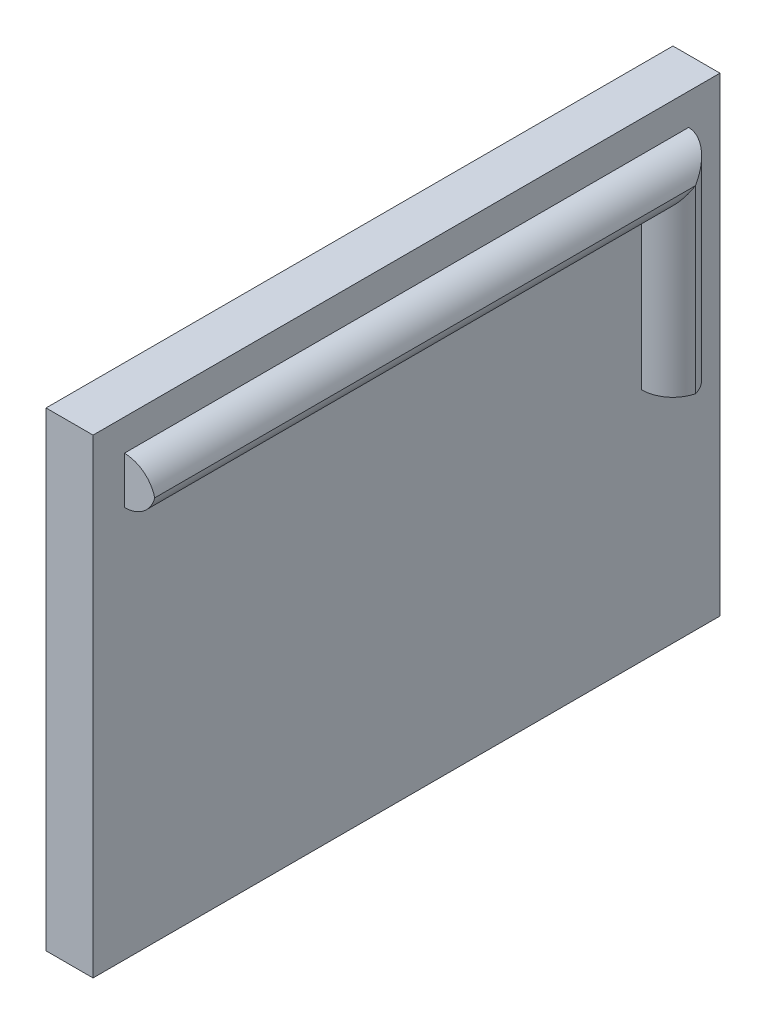
ISO-10303-21;
HEADER;
FILE_DESCRIPTION(('STEP AP214'),'2;1');
FILE_NAME('part.step','',(''),(''),'','','');
FILE_SCHEMA(('AUTOMOTIVE_DESIGN { 1 0 10303 214 1 1 1 1 }'));
ENDSEC;
DATA;
#1=APPLICATION_CONTEXT('core data for automotive mechanical design processes');
#2=APPLICATION_PROTOCOL_DEFINITION('international standard','automotive_design',2000,#1);
#3=PRODUCT_CONTEXT('',#1,'mechanical');
#4=PRODUCT('Part','Part','',(#3));
#5=PRODUCT_RELATED_PRODUCT_CATEGORY('part','',(#4));
#6=PRODUCT_DEFINITION_FORMATION('','',#4);
#7=PRODUCT_DEFINITION_CONTEXT('part definition',#1,'design');
#8=PRODUCT_DEFINITION('design','',#6,#7);
#9=PRODUCT_DEFINITION_SHAPE('','',#8);
#10=(LENGTH_UNIT() NAMED_UNIT(*) SI_UNIT(.MILLI.,.METRE.));
#11=(NAMED_UNIT(*) PLANE_ANGLE_UNIT() SI_UNIT($,.RADIAN.));
#12=(NAMED_UNIT(*) SI_UNIT($,.STERADIAN.) SOLID_ANGLE_UNIT());
#13=UNCERTAINTY_MEASURE_WITH_UNIT(LENGTH_MEASURE(1.E-05),#10,'distance_accuracy_value','');
#14=(GEOMETRIC_REPRESENTATION_CONTEXT(3) GLOBAL_UNCERTAINTY_ASSIGNED_CONTEXT((#13)) GLOBAL_UNIT_ASSIGNED_CONTEXT((#10,
#11,#12)) REPRESENTATION_CONTEXT('',''));
#15=CARTESIAN_POINT('',(0.,0.,0.));
#16=DIRECTION('',(0.,0.,1.));
#17=DIRECTION('',(1.,0.,0.));
#18=AXIS2_PLACEMENT_3D('',#15,#16,#17);
#19=CARTESIAN_POINT('',(3.,15.,-20.));
#20=DIRECTION('',(0.,0.,1.));
#21=DIRECTION('',(0.,-1.,0.));
#22=AXIS2_PLACEMENT_3D('',#19,#20,#21);
#23=PLANE('',#22);
#24=DIRECTION('',(0.,1.,0.));
#25=VECTOR('',#24,1.);
#26=CARTESIAN_POINT('',(0.,15.,-20.));
#27=LINE('',#26,#25);
#28=CARTESIAN_POINT('',(0.,-15.,-20.));
#29=VERTEX_POINT('',#28);
#30=CARTESIAN_POINT('',(0.,15.,-20.));
#31=VERTEX_POINT('',#30);
#32=EDGE_CURVE('E154',#29,#31,#27,.T.);
#33=ORIENTED_EDGE('',*,*,#32,.T.);
#34=DIRECTION('',(-1.,0.,0.));
#35=VECTOR('',#34,1.);
#36=CARTESIAN_POINT('',(3.,15.,-20.));
#37=LINE('',#36,#35);
#38=CARTESIAN_POINT('',(3.,15.,-20.));
#39=VERTEX_POINT('',#38);
#40=EDGE_CURVE('E134',#39,#31,#37,.T.);
#41=ORIENTED_EDGE('',*,*,#40,.F.);
#42=DIRECTION('',(0.,1.,0.));
#43=VECTOR('',#42,1.);
#44=CARTESIAN_POINT('',(3.,15.,-20.));
#45=LINE('',#44,#43);
#46=CARTESIAN_POINT('',(3.,-15.,-20.));
#47=VERTEX_POINT('',#46);
#48=EDGE_CURVE('E149',#47,#39,#45,.T.);
#49=ORIENTED_EDGE('',*,*,#48,.F.);
#50=DIRECTION('',(-1.,0.,0.));
#51=VECTOR('',#50,1.);
#52=CARTESIAN_POINT('',(3.,-15.,-20.));
#53=LINE('',#52,#51);
#54=EDGE_CURVE('E143',#47,#29,#53,.T.);
#55=ORIENTED_EDGE('',*,*,#54,.T.);
#56=EDGE_LOOP('',(#33,#41,#49,#55));
#57=FACE_BOUND('',#56,.T.);
#58=ADVANCED_FACE('F38',(#57),#23,.F.);
#59=CARTESIAN_POINT('',(3.,15.,20.));
#60=DIRECTION('',(0.,-1.,0.));
#61=DIRECTION('',(0.,0.,-1.));
#62=AXIS2_PLACEMENT_3D('',#59,#60,#61);
#63=PLANE('',#62);
#64=DIRECTION('',(0.,0.,1.));
#65=VECTOR('',#64,1.);
#66=CARTESIAN_POINT('',(0.,15.,20.));
#67=LINE('',#66,#65);
#68=CARTESIAN_POINT('',(0.,15.,20.));
#69=VERTEX_POINT('',#68);
#70=EDGE_CURVE('E152',#31,#69,#67,.T.);
#71=ORIENTED_EDGE('',*,*,#70,.T.);
#72=DIRECTION('',(-1.,0.,0.));
#73=VECTOR('',#72,1.);
#74=CARTESIAN_POINT('',(3.,15.,20.));
#75=LINE('',#74,#73);
#76=CARTESIAN_POINT('',(3.,15.,20.));
#77=VERTEX_POINT('',#76);
#78=EDGE_CURVE('E137',#77,#69,#75,.T.);
#79=ORIENTED_EDGE('',*,*,#78,.F.);
#80=DIRECTION('',(0.,0.,1.));
#81=VECTOR('',#80,1.);
#82=CARTESIAN_POINT('',(3.,15.,20.));
#83=LINE('',#82,#81);
#84=EDGE_CURVE('E161',#39,#77,#83,.T.);
#85=ORIENTED_EDGE('',*,*,#84,.F.);
#86=ORIENTED_EDGE('',*,*,#40,.T.);
#87=EDGE_LOOP('',(#71,#79,#85,#86));
#88=FACE_BOUND('',#87,.T.);
#89=ADVANCED_FACE('F193',(#88),#63,.F.);
#90=CARTESIAN_POINT('',(3.,15.,20.));
#91=DIRECTION('',(0.,0.,-1.));
#92=DIRECTION('',(0.,1.,0.));
#93=AXIS2_PLACEMENT_3D('',#90,#91,#92);
#94=PLANE('',#93);
#95=DIRECTION('',(0.,-1.,0.));
#96=VECTOR('',#95,1.);
#97=CARTESIAN_POINT('',(0.,15.,20.));
#98=LINE('',#97,#96);
#99=CARTESIAN_POINT('',(0.,-15.,20.));
#100=VERTEX_POINT('',#99);
#101=EDGE_CURVE('E150',#69,#100,#98,.T.);
#102=ORIENTED_EDGE('',*,*,#101,.T.);
#103=DIRECTION('',(-1.,0.,0.));
#104=VECTOR('',#103,1.);
#105=CARTESIAN_POINT('',(3.,-15.,20.));
#106=LINE('',#105,#104);
#107=CARTESIAN_POINT('',(3.,-15.,20.));
#108=VERTEX_POINT('',#107);
#109=EDGE_CURVE('E140',#108,#100,#106,.T.);
#110=ORIENTED_EDGE('',*,*,#109,.F.);
#111=DIRECTION('',(0.,-1.,0.));
#112=VECTOR('',#111,1.);
#113=CARTESIAN_POINT('',(3.,15.,20.));
#114=LINE('',#113,#112);
#115=EDGE_CURVE('E159',#77,#108,#114,.T.);
#116=ORIENTED_EDGE('',*,*,#115,.F.);
#117=ORIENTED_EDGE('',*,*,#78,.T.);
#118=EDGE_LOOP('',(#102,#110,#116,#117));
#119=FACE_BOUND('',#118,.T.);
#120=ADVANCED_FACE('F199',(#119),#94,.F.);
#121=CARTESIAN_POINT('',(3.,-15.,20.));
#122=DIRECTION('',(0.,1.,0.));
#123=DIRECTION('',(0.,0.,1.));
#124=AXIS2_PLACEMENT_3D('',#121,#122,#123);
#125=PLANE('',#124);
#126=DIRECTION('',(0.,0.,-1.));
#127=VECTOR('',#126,1.);
#128=CARTESIAN_POINT('',(0.,-15.,20.));
#129=LINE('',#128,#127);
#130=EDGE_CURVE('E147',#100,#29,#129,.T.);
#131=ORIENTED_EDGE('',*,*,#130,.T.);
#132=ORIENTED_EDGE('',*,*,#54,.F.);
#133=DIRECTION('',(0.,0.,-1.));
#134=VECTOR('',#133,1.);
#135=CARTESIAN_POINT('',(3.,-15.,20.));
#136=LINE('',#135,#134);
#137=EDGE_CURVE('E146',#108,#47,#136,.T.);
#138=ORIENTED_EDGE('',*,*,#137,.F.);
#139=ORIENTED_EDGE('',*,*,#109,.T.);
#140=EDGE_LOOP('',(#131,#132,#138,#139));
#141=FACE_BOUND('',#140,.T.);
#142=ADVANCED_FACE('F232',(#141),#125,.F.);
#143=CARTESIAN_POINT('',(3.,0.,0.));
#144=DIRECTION('',(1.,0.,0.));
#145=DIRECTION('',(0.,0.,-1.));
#146=AXIS2_PLACEMENT_3D('',#143,#144,#145);
#147=PLANE('',#146);
#148=DIRECTION('',(0.,0.,1.));
#149=VECTOR('',#148,1.);
#150=CARTESIAN_POINT('',(3.,10.,0.));
#151=LINE('',#150,#149);
#152=CARTESIAN_POINT('',(3.,10.,-15.));
#153=VERTEX_POINT('',#152);
#154=CARTESIAN_POINT('',(3.,9.99999999999999,18.));
#155=VERTEX_POINT('',#154);
#156=EDGE_CURVE('E113',#153,#155,#151,.T.);
#157=ORIENTED_EDGE('',*,*,#156,.T.);
#158=DIRECTION('',(0.,-1.,0.));
#159=VECTOR('',#158,1.);
#160=CARTESIAN_POINT('',(3.,0.,18.));
#161=LINE('',#160,#159);
#162=CARTESIAN_POINT('',(3.,13.,18.));
#163=VERTEX_POINT('',#162);
#164=EDGE_CURVE('E157',#163,#155,#161,.T.);
#165=ORIENTED_EDGE('',*,*,#164,.F.);
#166=DIRECTION('',(0.,0.,1.));
#167=VECTOR('',#166,1.);
#168=CARTESIAN_POINT('',(3.,13.,0.));
#169=LINE('',#168,#167);
#170=CARTESIAN_POINT('',(3.,13.,-18.));
#171=VERTEX_POINT('',#170);
#172=EDGE_CURVE('E166',#171,#163,#169,.T.);
#173=ORIENTED_EDGE('',*,*,#172,.F.);
#174=DIRECTION('',(0.,-1.,0.));
#175=VECTOR('',#174,1.);
#176=CARTESIAN_POINT('',(3.,0.,-18.));
#177=LINE('',#176,#175);
#178=CARTESIAN_POINT('',(3.,0.,-18.));
#179=VERTEX_POINT('',#178);
#180=EDGE_CURVE('E121',#171,#179,#177,.T.);
#181=ORIENTED_EDGE('',*,*,#180,.T.);
#182=DIRECTION('',(0.,0.,1.));
#183=VECTOR('',#182,1.);
#184=CARTESIAN_POINT('',(3.,0.,0.));
#185=LINE('',#184,#183);
#186=CARTESIAN_POINT('',(3.,0.,-15.));
#187=VERTEX_POINT('',#186);
#188=EDGE_CURVE('E169',#179,#187,#185,.T.);
#189=ORIENTED_EDGE('',*,*,#188,.T.);
#190=DIRECTION('',(0.,1.,0.));
#191=VECTOR('',#190,1.);
#192=CARTESIAN_POINT('',(3.,0.,-15.));
#193=LINE('',#192,#191);
#194=EDGE_CURVE('E172',#187,#153,#193,.T.);
#195=ORIENTED_EDGE('',*,*,#194,.T.);
#196=EDGE_LOOP('',(#157,#165,#173,#181,#189,#195));
#197=FACE_BOUND('',#196,.T.);
#198=ORIENTED_EDGE('',*,*,#48,.T.);
#199=ORIENTED_EDGE('',*,*,#84,.T.);
#200=ORIENTED_EDGE('',*,*,#115,.T.);
#201=ORIENTED_EDGE('',*,*,#137,.T.);
#202=EDGE_LOOP('',(#198,#199,#200,#201));
#203=FACE_BOUND('',#202,.T.);
#204=ADVANCED_FACE('F176',(#197,#203),#147,.T.);
#205=CARTESIAN_POINT('',(0.,0.,0.));
#206=DIRECTION('',(1.,0.,0.));
#207=DIRECTION('',(0.,0.,-1.));
#208=AXIS2_PLACEMENT_3D('',#205,#206,#207);
#209=PLANE('',#208);
#210=ORIENTED_EDGE('',*,*,#32,.F.);
#211=ORIENTED_EDGE('',*,*,#130,.F.);
#212=ORIENTED_EDGE('',*,*,#101,.F.);
#213=ORIENTED_EDGE('',*,*,#70,.F.);
#214=EDGE_LOOP('',(#210,#211,#212,#213));
#215=FACE_BOUND('',#214,.T.);
#216=ADVANCED_FACE('F182',(#215),#209,.F.);
#217=CARTESIAN_POINT('',(5.,0.,0.));
#218=DIRECTION('',(0.,-1.,0.));
#219=DIRECTION('',(0.,0.,-1.));
#220=AXIS2_PLACEMENT_3D('',#217,#218,#219);
#221=PLANE('',#220);
#222=CARTESIAN_POINT('',(3.,0.,-16.));
#223=DIRECTION('',(0.,-1.,0.));
#224=DIRECTION('',(0.,0.,-1.));
#225=AXIS2_PLACEMENT_3D('',#222,#223,#224);
#226=CIRCLE('',#225,2.);
#227=CARTESIAN_POINT('',(4.93649167310371,0.,-16.5));
#228=VERTEX_POINT('',#227);
#229=EDGE_CURVE('E132',#179,#228,#226,.T.);
#230=ORIENTED_EDGE('',*,*,#229,.T.);
#231=CARTESIAN_POINT('',(3.,0.,-17.));
#232=DIRECTION('',(0.,-1.,0.));
#233=DIRECTION('',(0.,0.,-1.));
#234=AXIS2_PLACEMENT_3D('',#231,#232,#233);
#235=CIRCLE('',#234,2.);
#236=EDGE_CURVE('E127',#228,#187,#235,.T.);
#237=ORIENTED_EDGE('',*,*,#236,.T.);
#238=ORIENTED_EDGE('',*,*,#188,.F.);
#239=EDGE_LOOP('',(#230,#237,#238));
#240=FACE_BOUND('',#239,.T.);
#241=ADVANCED_FACE('F179',(#240),#221,.T.);
#242=CARTESIAN_POINT('',(5.,0.,18.));
#243=DIRECTION('',(0.,0.,-1.));
#244=DIRECTION('',(-1.,0.,0.));
#245=AXIS2_PLACEMENT_3D('',#242,#243,#244);
#246=PLANE('',#245);
#247=ORIENTED_EDGE('',*,*,#164,.T.);
#248=CARTESIAN_POINT('',(3.,12.,18.));
#249=DIRECTION('',(0.,0.,-1.));
#250=DIRECTION('',(-1.,0.,0.));
#251=AXIS2_PLACEMENT_3D('',#248,#249,#250);
#252=CIRCLE('',#251,2.);
#253=CARTESIAN_POINT('',(4.93649167310371,11.5,18.));
#254=VERTEX_POINT('',#253);
#255=EDGE_CURVE('E11',#155,#254,#252,.F.);
#256=ORIENTED_EDGE('',*,*,#255,.T.);
#257=CARTESIAN_POINT('',(3.,11.,18.));
#258=DIRECTION('',(0.,0.,-1.));
#259=DIRECTION('',(-1.,0.,0.));
#260=AXIS2_PLACEMENT_3D('',#257,#258,#259);
#261=CIRCLE('',#260,2.);
#262=EDGE_CURVE('E48',#254,#163,#261,.F.);
#263=ORIENTED_EDGE('',*,*,#262,.T.);
#264=EDGE_LOOP('',(#247,#256,#263));
#265=FACE_BOUND('',#264,.T.);
#266=ADVANCED_FACE('F181',(#265),#246,.F.);
#267=CARTESIAN_POINT('',(3.,11.,0.));
#268=DIRECTION('',(0.,0.,-1.));
#269=DIRECTION('',(-1.,0.,0.));
#270=AXIS2_PLACEMENT_3D('',#267,#268,#269);
#271=CYLINDRICAL_SURFACE('',#270,2.);
#272=ORIENTED_EDGE('',*,*,#172,.T.);
#273=ORIENTED_EDGE('',*,*,#262,.F.);
#274=DIRECTION('',(0.,0.,-1.));
#275=VECTOR('',#274,1.);
#276=CARTESIAN_POINT('',(4.93649167310371,11.5,-0.108));
#277=LINE('',#276,#275);
#278=CARTESIAN_POINT('',(4.9364916731037,11.5,-16.5));
#279=VERTEX_POINT('',#278);
#280=EDGE_CURVE('E42',#279,#254,#277,.F.);
#281=ORIENTED_EDGE('',*,*,#280,.F.);
#282=CARTESIAN_POINT('',(3.,11.,-16.));
#283=DIRECTION('',(0.,-0.707106781186547,-0.707106781186547));
#284=DIRECTION('',(0.,-0.707106781186547,0.707106781186547));
#285=AXIS2_PLACEMENT_3D('',#282,#283,#284);
#286=ELLIPSE('',#285,2.82842712474619,2.);
#287=EDGE_CURVE('E110',#171,#279,#286,.T.);
#288=ORIENTED_EDGE('',*,*,#287,.F.);
#289=EDGE_LOOP('',(#272,#273,#281,#288));
#290=FACE_BOUND('',#289,.T.);
#291=ADVANCED_FACE('F40',(#290),#271,.T.);
#292=CARTESIAN_POINT('',(3.,12.,0.));
#293=DIRECTION('',(0.,0.,1.));
#294=DIRECTION('',(0.,-1.,0.));
#295=AXIS2_PLACEMENT_3D('',#292,#293,#294);
#296=CYLINDRICAL_SURFACE('',#295,2.);
#297=ORIENTED_EDGE('',*,*,#255,.F.);
#298=ORIENTED_EDGE('',*,*,#156,.F.);
#299=CARTESIAN_POINT('',(3.,12.,-17.));
#300=DIRECTION('',(0.,0.707106781186547,0.707106781186548));
#301=DIRECTION('',(0.,0.707106781186548,-0.707106781186547));
#302=AXIS2_PLACEMENT_3D('',#299,#300,#301);
#303=ELLIPSE('',#302,2.82842712474619,2.);
#304=EDGE_CURVE('E102',#279,#153,#303,.F.);
#305=ORIENTED_EDGE('',*,*,#304,.F.);
#306=ORIENTED_EDGE('',*,*,#280,.T.);
#307=EDGE_LOOP('',(#297,#298,#305,#306));
#308=FACE_BOUND('',#307,.T.);
#309=ADVANCED_FACE('F122',(#308),#296,.T.);
#310=CARTESIAN_POINT('',(3.,0.,-16.));
#311=DIRECTION('',(0.,-1.,0.));
#312=DIRECTION('',(0.,0.,-1.));
#313=AXIS2_PLACEMENT_3D('',#310,#311,#312);
#314=CYLINDRICAL_SURFACE('',#313,2.);
#315=ORIENTED_EDGE('',*,*,#180,.F.);
#316=ORIENTED_EDGE('',*,*,#287,.T.);
#317=DIRECTION('',(0.,-1.,0.));
#318=VECTOR('',#317,1.);
#319=CARTESIAN_POINT('',(4.93649167310371,6.539,-16.5));
#320=LINE('',#319,#318);
#321=EDGE_CURVE('E118',#228,#279,#320,.F.);
#322=ORIENTED_EDGE('',*,*,#321,.F.);
#323=ORIENTED_EDGE('',*,*,#229,.F.);
#324=EDGE_LOOP('',(#315,#316,#322,#323));
#325=FACE_BOUND('',#324,.T.);
#326=ADVANCED_FACE('F116',(#325),#314,.T.);
#327=CARTESIAN_POINT('',(3.,0.,-17.));
#328=DIRECTION('',(0.,1.,0.));
#329=DIRECTION('',(0.,0.,1.));
#330=AXIS2_PLACEMENT_3D('',#327,#328,#329);
#331=CYLINDRICAL_SURFACE('',#330,2.);
#332=ORIENTED_EDGE('',*,*,#321,.T.);
#333=ORIENTED_EDGE('',*,*,#304,.T.);
#334=ORIENTED_EDGE('',*,*,#194,.F.);
#335=ORIENTED_EDGE('',*,*,#236,.F.);
#336=EDGE_LOOP('',(#332,#333,#334,#335));
#337=FACE_BOUND('',#336,.T.);
#338=ADVANCED_FACE('F126',(#337),#331,.T.);
#339=CLOSED_SHELL('',(#58,#89,#120,#142,#204,#216,#241,#266,#291,#309,#326,#338));
#340=MANIFOLD_SOLID_BREP('B2',#339);
#341=ADVANCED_BREP_SHAPE_REPRESENTATION('',(#18,#340),#14);
#342=SHAPE_DEFINITION_REPRESENTATION(#9,#341);
ENDSEC;
END-ISO-10303-21;
